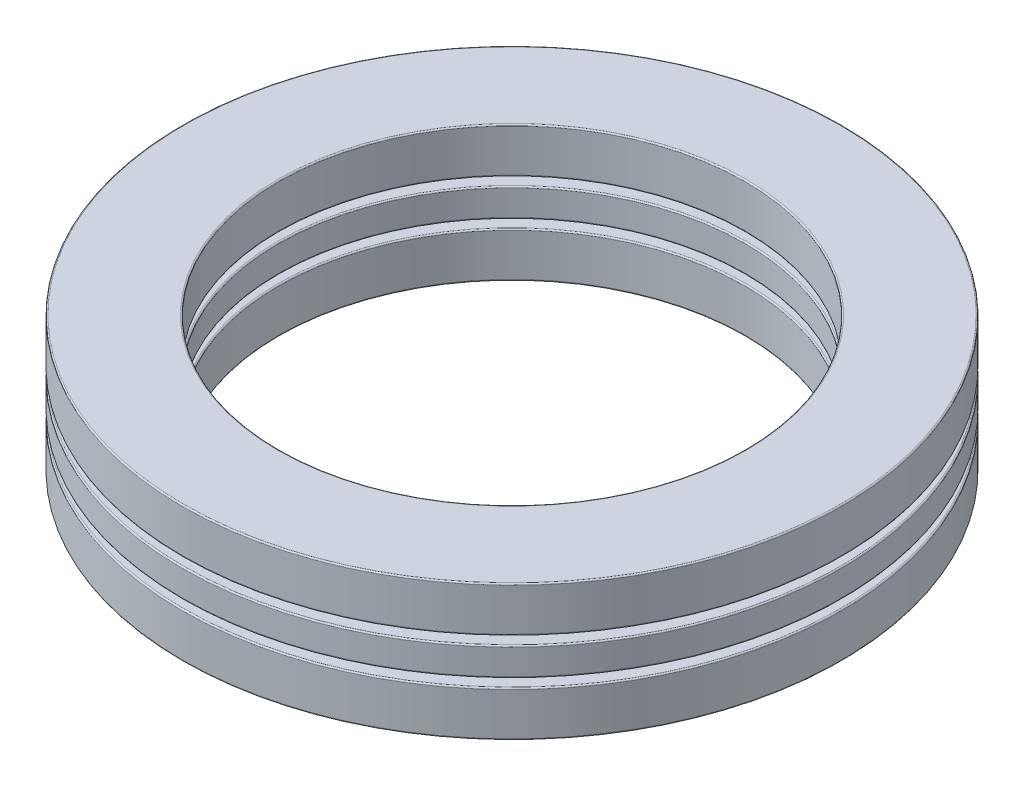
ISO-10303-21;
HEADER;
FILE_DESCRIPTION(('STEP AP214'),'2;1');
FILE_NAME('part.step','',(''),(''),'','','');
FILE_SCHEMA(('AUTOMOTIVE_DESIGN { 1 0 10303 214 1 1 1 1 }'));
ENDSEC;
DATA;
#1=APPLICATION_CONTEXT('core data for automotive mechanical design processes');
#2=APPLICATION_PROTOCOL_DEFINITION('international standard','automotive_design',2000,#1);
#3=PRODUCT_CONTEXT('',#1,'mechanical');
#4=PRODUCT('Part','Part','',(#3));
#5=PRODUCT_RELATED_PRODUCT_CATEGORY('part','',(#4));
#6=PRODUCT_DEFINITION_FORMATION('','',#4);
#7=PRODUCT_DEFINITION_CONTEXT('part definition',#1,'design');
#8=PRODUCT_DEFINITION('design','',#6,#7);
#9=PRODUCT_DEFINITION_SHAPE('','',#8);
#10=(LENGTH_UNIT() NAMED_UNIT(*) SI_UNIT(.MILLI.,.METRE.));
#11=(NAMED_UNIT(*) PLANE_ANGLE_UNIT() SI_UNIT($,.RADIAN.));
#12=(NAMED_UNIT(*) SI_UNIT($,.STERADIAN.) SOLID_ANGLE_UNIT());
#13=UNCERTAINTY_MEASURE_WITH_UNIT(LENGTH_MEASURE(1.E-05),#10,'distance_accuracy_value','');
#14=(GEOMETRIC_REPRESENTATION_CONTEXT(3) GLOBAL_UNCERTAINTY_ASSIGNED_CONTEXT((#13)) GLOBAL_UNIT_ASSIGNED_CONTEXT((#10,
#11,#12)) REPRESENTATION_CONTEXT('',''));
#15=CARTESIAN_POINT('',(0.,0.,0.));
#16=DIRECTION('',(0.,0.,1.));
#17=DIRECTION('',(1.,0.,0.));
#18=AXIS2_PLACEMENT_3D('',#15,#16,#17);
#19=CARTESIAN_POINT('',(0.,-5.5499,0.));
#20=DIRECTION('',(0.,-1.,0.));
#21=DIRECTION('',(0.,0.,-1.));
#22=AXIS2_PLACEMENT_3D('',#19,#20,#21);
#23=CYLINDRICAL_SURFACE('',#22,26.9875);
#24=CARTESIAN_POINT('',(0.,-5.438902,0.));
#25=DIRECTION('',(0.,1.,0.));
#26=DIRECTION('',(0.,0.,1.));
#27=AXIS2_PLACEMENT_3D('',#24,#25,#26);
#28=CIRCLE('',#27,26.9875);
#29=CARTESIAN_POINT('',(0.,-5.438902,26.9875));
#30=VERTEX_POINT('',#29);
#31=EDGE_CURVE('E11',#30,#30,#28,.T.);
#32=ORIENTED_EDGE('',*,*,#31,.T.);
#33=EDGE_LOOP('',(#32));
#34=FACE_BOUND('',#33,.T.);
#35=CARTESIAN_POINT('',(0.,-1.96096466666667,0.));
#36=DIRECTION('',(0.,-1.,0.));
#37=DIRECTION('',(0.,0.,-1.));
#38=AXIS2_PLACEMENT_3D('',#35,#36,#37);
#39=CIRCLE('',#38,26.9875);
#40=CARTESIAN_POINT('',(0.,-1.96096466666667,-26.9875));
#41=VERTEX_POINT('',#40);
#42=EDGE_CURVE('E51',#41,#41,#39,.T.);
#43=ORIENTED_EDGE('',*,*,#42,.T.);
#44=EDGE_LOOP('',(#43));
#45=FACE_BOUND('',#44,.T.);
#46=ADVANCED_FACE('F44',(#34,#45),#23,.T.);
#47=CARTESIAN_POINT('',(0.,-1.84996666666667,26.9875));
#48=DIRECTION('',(0.,-1.,0.));
#49=DIRECTION('',(0.,0.,-1.));
#50=AXIS2_PLACEMENT_3D('',#47,#48,#49);
#51=PLANE('',#50);
#52=CARTESIAN_POINT('',(0.,-1.84996666666667,0.));
#53=DIRECTION('',(0.,-1.,0.));
#54=DIRECTION('',(0.,0.,-1.));
#55=AXIS2_PLACEMENT_3D('',#52,#53,#54);
#56=CIRCLE('',#55,19.199098);
#57=CARTESIAN_POINT('',(0.,-1.84996666666667,-19.199098));
#58=VERTEX_POINT('',#57);
#59=EDGE_CURVE('E55',#58,#58,#56,.T.);
#60=ORIENTED_EDGE('',*,*,#59,.T.);
#61=EDGE_LOOP('',(#60));
#62=FACE_BOUND('',#61,.T.);
#63=CARTESIAN_POINT('',(0.,-1.84996666666667,0.));
#64=DIRECTION('',(0.,-1.,0.));
#65=DIRECTION('',(0.,0.,-1.));
#66=AXIS2_PLACEMENT_3D('',#63,#64,#65);
#67=CIRCLE('',#66,26.876502);
#68=CARTESIAN_POINT('',(0.,-1.84996666666667,-26.876502));
#69=VERTEX_POINT('',#68);
#70=EDGE_CURVE('E59',#69,#69,#67,.F.);
#71=ORIENTED_EDGE('',*,*,#70,.T.);
#72=EDGE_LOOP('',(#71));
#73=FACE_BOUND('',#72,.T.);
#74=ADVANCED_FACE('F87',(#62,#73),#51,.F.);
#75=CARTESIAN_POINT('',(0.,-5.5499,0.));
#76=DIRECTION('',(0.,-1.,0.));
#77=DIRECTION('',(0.,0.,-1.));
#78=AXIS2_PLACEMENT_3D('',#75,#76,#77);
#79=CYLINDRICAL_SURFACE('',#78,19.0881);
#80=CARTESIAN_POINT('',(0.,-5.438902,0.));
#81=DIRECTION('',(0.,1.,0.));
#82=DIRECTION('',(0.,0.,1.));
#83=AXIS2_PLACEMENT_3D('',#80,#81,#82);
#84=CIRCLE('',#83,19.0881);
#85=CARTESIAN_POINT('',(0.,-5.438902,19.0881));
#86=VERTEX_POINT('',#85);
#87=EDGE_CURVE('E70',#86,#86,#84,.F.);
#88=ORIENTED_EDGE('',*,*,#87,.T.);
#89=EDGE_LOOP('',(#88));
#90=FACE_BOUND('',#89,.T.);
#91=CARTESIAN_POINT('',(0.,-1.96096466666667,0.));
#92=DIRECTION('',(0.,-1.,0.));
#93=DIRECTION('',(0.,0.,-1.));
#94=AXIS2_PLACEMENT_3D('',#91,#92,#93);
#95=CIRCLE('',#94,19.0881);
#96=CARTESIAN_POINT('',(0.,-1.96096466666667,-19.0881));
#97=VERTEX_POINT('',#96);
#98=EDGE_CURVE('E73',#97,#97,#95,.F.);
#99=ORIENTED_EDGE('',*,*,#98,.T.);
#100=EDGE_LOOP('',(#99));
#101=FACE_BOUND('',#100,.T.);
#102=ADVANCED_FACE('F77',(#90,#101),#79,.F.);
#103=CARTESIAN_POINT('',(0.,-5.5499,26.9875));
#104=DIRECTION('',(0.,1.,0.));
#105=DIRECTION('',(0.,0.,1.));
#106=AXIS2_PLACEMENT_3D('',#103,#104,#105);
#107=PLANE('',#106);
#108=CARTESIAN_POINT('',(0.,-5.5499,0.));
#109=DIRECTION('',(0.,1.,0.));
#110=DIRECTION('',(0.,0.,1.));
#111=AXIS2_PLACEMENT_3D('',#108,#109,#110);
#112=CIRCLE('',#111,19.199098);
#113=CARTESIAN_POINT('',(0.,-5.5499,19.199098));
#114=VERTEX_POINT('',#113);
#115=EDGE_CURVE('E64',#114,#114,#112,.T.);
#116=ORIENTED_EDGE('',*,*,#115,.T.);
#117=EDGE_LOOP('',(#116));
#118=FACE_BOUND('',#117,.T.);
#119=CARTESIAN_POINT('',(0.,-5.5499,0.));
#120=DIRECTION('',(0.,1.,0.));
#121=DIRECTION('',(0.,0.,1.));
#122=AXIS2_PLACEMENT_3D('',#119,#120,#121);
#123=CIRCLE('',#122,26.876502);
#124=CARTESIAN_POINT('',(0.,-5.5499,26.876502));
#125=VERTEX_POINT('',#124);
#126=EDGE_CURVE('E67',#125,#125,#123,.F.);
#127=ORIENTED_EDGE('',*,*,#126,.T.);
#128=EDGE_LOOP('',(#127));
#129=FACE_BOUND('',#128,.T.);
#130=ADVANCED_FACE('F106',(#118,#129),#107,.F.);
#131=CARTESIAN_POINT('',(0.,-5.438902,0.));
#132=DIRECTION('',(0.,1.,0.));
#133=DIRECTION('',(0.,0.,1.));
#134=AXIS2_PLACEMENT_3D('',#131,#132,#133);
#135=TOROIDAL_SURFACE('',#134,19.199098,0.110998);
#136=ORIENTED_EDGE('',*,*,#115,.F.);
#137=EDGE_LOOP('',(#136));
#138=FACE_BOUND('',#137,.T.);
#139=ORIENTED_EDGE('',*,*,#87,.F.);
#140=EDGE_LOOP('',(#139));
#141=FACE_BOUND('',#140,.T.);
#142=ADVANCED_FACE('F83',(#138,#141),#135,.T.);
#143=CARTESIAN_POINT('',(0.,-1.96096466666667,0.));
#144=DIRECTION('',(0.,-1.,0.));
#145=DIRECTION('',(0.,0.,-1.));
#146=AXIS2_PLACEMENT_3D('',#143,#144,#145);
#147=TOROIDAL_SURFACE('',#146,19.199098,0.110998);
#148=ORIENTED_EDGE('',*,*,#98,.F.);
#149=EDGE_LOOP('',(#148));
#150=FACE_BOUND('',#149,.T.);
#151=ORIENTED_EDGE('',*,*,#59,.F.);
#152=EDGE_LOOP('',(#151));
#153=FACE_BOUND('',#152,.T.);
#154=ADVANCED_FACE('F79',(#150,#153),#147,.T.);
#155=CARTESIAN_POINT('',(0.,-5.438902,0.));
#156=DIRECTION('',(0.,1.,0.));
#157=DIRECTION('',(0.,0.,1.));
#158=AXIS2_PLACEMENT_3D('',#155,#156,#157);
#159=TOROIDAL_SURFACE('',#158,26.876502,0.110998);
#160=ORIENTED_EDGE('',*,*,#31,.F.);
#161=EDGE_LOOP('',(#160));
#162=FACE_BOUND('',#161,.T.);
#163=ORIENTED_EDGE('',*,*,#126,.F.);
#164=EDGE_LOOP('',(#163));
#165=FACE_BOUND('',#164,.T.);
#166=ADVANCED_FACE('F82',(#162,#165),#159,.T.);
#167=CARTESIAN_POINT('',(0.,-1.96096466666667,0.));
#168=DIRECTION('',(0.,-1.,0.));
#169=DIRECTION('',(0.,0.,-1.));
#170=AXIS2_PLACEMENT_3D('',#167,#168,#169);
#171=TOROIDAL_SURFACE('',#170,26.876502,0.110998);
#172=ORIENTED_EDGE('',*,*,#70,.F.);
#173=EDGE_LOOP('',(#172));
#174=FACE_BOUND('',#173,.T.);
#175=ORIENTED_EDGE('',*,*,#42,.F.);
#176=EDGE_LOOP('',(#175));
#177=FACE_BOUND('',#176,.T.);
#178=ADVANCED_FACE('F46',(#174,#177),#171,.T.);
#179=CLOSED_SHELL('',(#46,#74,#102,#130,#142,#154,#166,#178));
#180=MANIFOLD_SOLID_BREP('B2',#179);
#181=CARTESIAN_POINT('',(0.,-5.5499,0.));
#182=DIRECTION('',(0.,-1.,0.));
#183=DIRECTION('',(0.,0.,-1.));
#184=AXIS2_PLACEMENT_3D('',#181,#182,#183);
#185=CYLINDRICAL_SURFACE('',#184,26.9875);
#186=CARTESIAN_POINT('',(0.,1.96096466666667,0.));
#187=DIRECTION('',(0.,1.,0.));
#188=DIRECTION('',(0.,0.,1.));
#189=AXIS2_PLACEMENT_3D('',#186,#187,#188);
#190=CIRCLE('',#189,26.9875);
#191=CARTESIAN_POINT('',(0.,1.96096466666667,26.9875));
#192=VERTEX_POINT('',#191);
#193=EDGE_CURVE('E43',#192,#192,#190,.T.);
#194=ORIENTED_EDGE('',*,*,#193,.T.);
#195=EDGE_LOOP('',(#194));
#196=FACE_BOUND('',#195,.T.);
#197=CARTESIAN_POINT('',(0.,5.438902,0.));
#198=DIRECTION('',(0.,-1.,0.));
#199=DIRECTION('',(0.,0.,-1.));
#200=AXIS2_PLACEMENT_3D('',#197,#198,#199);
#201=CIRCLE('',#200,26.9875);
#202=CARTESIAN_POINT('',(0.,5.438902,-26.9875));
#203=VERTEX_POINT('',#202);
#204=EDGE_CURVE('E163',#203,#203,#201,.T.);
#205=ORIENTED_EDGE('',*,*,#204,.T.);
#206=EDGE_LOOP('',(#205));
#207=FACE_BOUND('',#206,.T.);
#208=ADVANCED_FACE('F156',(#196,#207),#185,.T.);
#209=CARTESIAN_POINT('',(0.,5.5499,26.9875));
#210=DIRECTION('',(0.,-1.,0.));
#211=DIRECTION('',(0.,0.,-1.));
#212=AXIS2_PLACEMENT_3D('',#209,#210,#211);
#213=PLANE('',#212);
#214=CARTESIAN_POINT('',(0.,5.5499,0.));
#215=DIRECTION('',(0.,-1.,0.));
#216=DIRECTION('',(0.,0.,-1.));
#217=AXIS2_PLACEMENT_3D('',#214,#215,#216);
#218=CIRCLE('',#217,19.199098);
#219=CARTESIAN_POINT('',(0.,5.5499,-19.199098));
#220=VERTEX_POINT('',#219);
#221=EDGE_CURVE('E167',#220,#220,#218,.T.);
#222=ORIENTED_EDGE('',*,*,#221,.T.);
#223=EDGE_LOOP('',(#222));
#224=FACE_BOUND('',#223,.T.);
#225=CARTESIAN_POINT('',(0.,5.5499,0.));
#226=DIRECTION('',(0.,-1.,0.));
#227=DIRECTION('',(0.,0.,-1.));
#228=AXIS2_PLACEMENT_3D('',#225,#226,#227);
#229=CIRCLE('',#228,26.876502);
#230=CARTESIAN_POINT('',(0.,5.5499,-26.876502));
#231=VERTEX_POINT('',#230);
#232=EDGE_CURVE('E171',#231,#231,#229,.F.);
#233=ORIENTED_EDGE('',*,*,#232,.T.);
#234=EDGE_LOOP('',(#233));
#235=FACE_BOUND('',#234,.T.);
#236=ADVANCED_FACE('F199',(#224,#235),#213,.F.);
#237=CARTESIAN_POINT('',(0.,-5.5499,0.));
#238=DIRECTION('',(0.,-1.,0.));
#239=DIRECTION('',(0.,0.,-1.));
#240=AXIS2_PLACEMENT_3D('',#237,#238,#239);
#241=CYLINDRICAL_SURFACE('',#240,19.0881);
#242=CARTESIAN_POINT('',(0.,1.96096466666667,0.));
#243=DIRECTION('',(0.,1.,0.));
#244=DIRECTION('',(0.,0.,1.));
#245=AXIS2_PLACEMENT_3D('',#242,#243,#244);
#246=CIRCLE('',#245,19.0881);
#247=CARTESIAN_POINT('',(0.,1.96096466666667,19.0881));
#248=VERTEX_POINT('',#247);
#249=EDGE_CURVE('E182',#248,#248,#246,.F.);
#250=ORIENTED_EDGE('',*,*,#249,.T.);
#251=EDGE_LOOP('',(#250));
#252=FACE_BOUND('',#251,.T.);
#253=CARTESIAN_POINT('',(0.,5.438902,0.));
#254=DIRECTION('',(0.,-1.,0.));
#255=DIRECTION('',(0.,0.,-1.));
#256=AXIS2_PLACEMENT_3D('',#253,#254,#255);
#257=CIRCLE('',#256,19.0881);
#258=CARTESIAN_POINT('',(0.,5.438902,-19.0881));
#259=VERTEX_POINT('',#258);
#260=EDGE_CURVE('E185',#259,#259,#257,.F.);
#261=ORIENTED_EDGE('',*,*,#260,.T.);
#262=EDGE_LOOP('',(#261));
#263=FACE_BOUND('',#262,.T.);
#264=ADVANCED_FACE('F189',(#252,#263),#241,.F.);
#265=CARTESIAN_POINT('',(0.,1.84996666666667,26.9875));
#266=DIRECTION('',(0.,1.,0.));
#267=DIRECTION('',(0.,0.,1.));
#268=AXIS2_PLACEMENT_3D('',#265,#266,#267);
#269=PLANE('',#268);
#270=CARTESIAN_POINT('',(0.,1.84996666666667,0.));
#271=DIRECTION('',(0.,1.,0.));
#272=DIRECTION('',(0.,0.,1.));
#273=AXIS2_PLACEMENT_3D('',#270,#271,#272);
#274=CIRCLE('',#273,19.199098);
#275=CARTESIAN_POINT('',(0.,1.84996666666667,19.199098));
#276=VERTEX_POINT('',#275);
#277=EDGE_CURVE('E176',#276,#276,#274,.T.);
#278=ORIENTED_EDGE('',*,*,#277,.T.);
#279=EDGE_LOOP('',(#278));
#280=FACE_BOUND('',#279,.T.);
#281=CARTESIAN_POINT('',(0.,1.84996666666667,0.));
#282=DIRECTION('',(0.,1.,0.));
#283=DIRECTION('',(0.,0.,1.));
#284=AXIS2_PLACEMENT_3D('',#281,#282,#283);
#285=CIRCLE('',#284,26.876502);
#286=CARTESIAN_POINT('',(0.,1.84996666666667,26.876502));
#287=VERTEX_POINT('',#286);
#288=EDGE_CURVE('E179',#287,#287,#285,.F.);
#289=ORIENTED_EDGE('',*,*,#288,.T.);
#290=EDGE_LOOP('',(#289));
#291=FACE_BOUND('',#290,.T.);
#292=ADVANCED_FACE('F218',(#280,#291),#269,.F.);
#293=CARTESIAN_POINT('',(0.,1.96096466666667,0.));
#294=DIRECTION('',(0.,1.,0.));
#295=DIRECTION('',(0.,0.,1.));
#296=AXIS2_PLACEMENT_3D('',#293,#294,#295);
#297=TOROIDAL_SURFACE('',#296,19.199098,0.110998);
#298=ORIENTED_EDGE('',*,*,#277,.F.);
#299=EDGE_LOOP('',(#298));
#300=FACE_BOUND('',#299,.T.);
#301=ORIENTED_EDGE('',*,*,#249,.F.);
#302=EDGE_LOOP('',(#301));
#303=FACE_BOUND('',#302,.T.);
#304=ADVANCED_FACE('F195',(#300,#303),#297,.T.);
#305=CARTESIAN_POINT('',(0.,5.438902,0.));
#306=DIRECTION('',(0.,-1.,0.));
#307=DIRECTION('',(0.,0.,-1.));
#308=AXIS2_PLACEMENT_3D('',#305,#306,#307);
#309=TOROIDAL_SURFACE('',#308,19.199098,0.110998);
#310=ORIENTED_EDGE('',*,*,#260,.F.);
#311=EDGE_LOOP('',(#310));
#312=FACE_BOUND('',#311,.T.);
#313=ORIENTED_EDGE('',*,*,#221,.F.);
#314=EDGE_LOOP('',(#313));
#315=FACE_BOUND('',#314,.T.);
#316=ADVANCED_FACE('F191',(#312,#315),#309,.T.);
#317=CARTESIAN_POINT('',(0.,1.96096466666667,0.));
#318=DIRECTION('',(0.,1.,0.));
#319=DIRECTION('',(0.,0.,1.));
#320=AXIS2_PLACEMENT_3D('',#317,#318,#319);
#321=TOROIDAL_SURFACE('',#320,26.876502,0.110998);
#322=ORIENTED_EDGE('',*,*,#193,.F.);
#323=EDGE_LOOP('',(#322));
#324=FACE_BOUND('',#323,.T.);
#325=ORIENTED_EDGE('',*,*,#288,.F.);
#326=EDGE_LOOP('',(#325));
#327=FACE_BOUND('',#326,.T.);
#328=ADVANCED_FACE('F194',(#324,#327),#321,.T.);
#329=CARTESIAN_POINT('',(0.,5.438902,0.));
#330=DIRECTION('',(0.,-1.,0.));
#331=DIRECTION('',(0.,0.,-1.));
#332=AXIS2_PLACEMENT_3D('',#329,#330,#331);
#333=TOROIDAL_SURFACE('',#332,26.876502,0.110998);
#334=ORIENTED_EDGE('',*,*,#232,.F.);
#335=EDGE_LOOP('',(#334));
#336=FACE_BOUND('',#335,.T.);
#337=ORIENTED_EDGE('',*,*,#204,.F.);
#338=EDGE_LOOP('',(#337));
#339=FACE_BOUND('',#338,.T.);
#340=ADVANCED_FACE('F158',(#336,#339),#333,.T.);
#341=CLOSED_SHELL('',(#208,#236,#264,#292,#304,#316,#328,#340));
#342=MANIFOLD_SOLID_BREP('B6',#341);
#343=CARTESIAN_POINT('',(-12.4551750243783,0.,19.3806306386583));
#344=DIRECTION('',(0.,1.,0.));
#345=DIRECTION('',(0.540640817455587,0.,-0.841253532831188));
#346=AXIS2_PLACEMENT_3D('',#343,#344,#345);
#347=SPHERICAL_SURFACE('',#346,1.84996666666667);
#348=CARTESIAN_POINT('',(-12.4551750243783,1.84996666666667,19.3806306386583));
#349=VERTEX_POINT('',#348);
#350=VERTEX_LOOP('',#349);
#351=FACE_BOUND('',#350,.T.);
#352=ADVANCED_FACE('F268',(#351),#347,.T.);
#353=CLOSED_SHELL('',(#352));
#354=MANIFOLD_SOLID_BREP('B38',#353);
#355=CARTESIAN_POINT('',(-20.9559199825782,0.,9.57024798653509));
#356=DIRECTION('',(0.,1.,0.));
#357=DIRECTION('',(0.909631995354514,0.,-0.415415013001897));
#358=AXIS2_PLACEMENT_3D('',#355,#356,#357);
#359=SPHERICAL_SURFACE('',#358,1.84996666666667);
#360=CARTESIAN_POINT('',(-20.9559199825782,1.84996666666667,9.57024798653509));
#361=VERTEX_POINT('',#360);
#362=VERTEX_LOOP('',#361);
#363=FACE_BOUND('',#362,.T.);
#364=ADVANCED_FACE('F285',(#363),#359,.T.);
#365=CLOSED_SHELL('',(#364));
#366=MANIFOLD_SOLID_BREP('B152',#365);
#367=CARTESIAN_POINT('',(-22.8033084137646,0.,-3.27862078117207));
#368=DIRECTION('',(0.,1.,0.));
#369=DIRECTION('',(0.989821441880934,0.,0.142314838273276));
#370=AXIS2_PLACEMENT_3D('',#367,#368,#369);
#371=SPHERICAL_SURFACE('',#370,1.84996666666667);
#372=CARTESIAN_POINT('',(-22.8033084137646,1.84996666666667,-3.27862078117207));
#373=VERTEX_POINT('',#372);
#374=VERTEX_LOOP('',#373);
#375=FACE_BOUND('',#374,.T.);
#376=ADVANCED_FACE('F302',(#375),#371,.T.);
#377=CLOSED_SHELL('',(#376));
#378=MANIFOLD_SOLID_BREP('B264',#377);
#379=CARTESIAN_POINT('',(-17.4108075440587,0.,-15.0865506164845));
#380=DIRECTION('',(0.,1.,0.));
#381=DIRECTION('',(0.755749574354264,0.,0.654860733945279));
#382=AXIS2_PLACEMENT_3D('',#379,#380,#381);
#383=SPHERICAL_SURFACE('',#382,1.84996666666667);
#384=CARTESIAN_POINT('',(-17.4108075440587,1.84996666666667,-15.0865506164845));
#385=VERTEX_POINT('',#384);
#386=VERTEX_LOOP('',#385);
#387=FACE_BOUND('',#386,.T.);
#388=ADVANCED_FACE('F319',(#387),#383,.T.);
#389=CLOSED_SHELL('',(#388));
#390=MANIFOLD_SOLID_BREP('B281',#389);
#391=CARTESIAN_POINT('',(-6.49049829800165,0.,-22.104607227536));
#392=DIRECTION('',(0.,1.,0.));
#393=DIRECTION('',(0.281732556841437,0.,0.959492973614495));
#394=AXIS2_PLACEMENT_3D('',#391,#392,#393);
#395=SPHERICAL_SURFACE('',#394,1.84996666666667);
#396=CARTESIAN_POINT('',(-6.49049829800165,1.84996666666667,-22.104607227536));
#397=VERTEX_POINT('',#396);
#398=VERTEX_LOOP('',#397);
#399=FACE_BOUND('',#398,.T.);
#400=ADVANCED_FACE('F336',(#399),#395,.T.);
#401=CLOSED_SHELL('',(#400));
#402=MANIFOLD_SOLID_BREP('B298',#401);
#403=CARTESIAN_POINT('',(6.49049829800135,0.,-22.1046072275361));
#404=DIRECTION('',(0.,1.,0.));
#405=DIRECTION('',(-0.281732556841424,0.,0.959492973614499));
#406=AXIS2_PLACEMENT_3D('',#403,#404,#405);
#407=SPHERICAL_SURFACE('',#406,1.84996666666667);
#408=CARTESIAN_POINT('',(6.49049829800135,1.84996666666667,-22.1046072275361));
#409=VERTEX_POINT('',#408);
#410=VERTEX_LOOP('',#409);
#411=FACE_BOUND('',#410,.T.);
#412=ADVANCED_FACE('F353',(#411),#407,.T.);
#413=CLOSED_SHELL('',(#412));
#414=MANIFOLD_SOLID_BREP('B315',#413);
#415=CARTESIAN_POINT('',(17.4108075440585,0.,-15.0865506164848));
#416=DIRECTION('',(0.,1.,0.));
#417=DIRECTION('',(-0.755749574354255,0.,0.654860733945289));
#418=AXIS2_PLACEMENT_3D('',#415,#416,#417);
#419=SPHERICAL_SURFACE('',#418,1.84996666666667);
#420=CARTESIAN_POINT('',(17.4108075440585,1.84996666666667,-15.0865506164848));
#421=VERTEX_POINT('',#420);
#422=VERTEX_LOOP('',#421);
#423=FACE_BOUND('',#422,.T.);
#424=ADVANCED_FACE('F370',(#423),#419,.T.);
#425=CLOSED_SHELL('',(#424));
#426=MANIFOLD_SOLID_BREP('B332',#425);
#427=CARTESIAN_POINT('',(22.8033084137645,0.,-3.27862078117237));
#428=DIRECTION('',(0.,1.,0.));
#429=DIRECTION('',(-0.989821441880932,0.,0.142314838273289));
#430=AXIS2_PLACEMENT_3D('',#427,#428,#429);
#431=SPHERICAL_SURFACE('',#430,1.84996666666667);
#432=CARTESIAN_POINT('',(22.8033084137645,1.84996666666667,-3.27862078117237));
#433=VERTEX_POINT('',#432);
#434=VERTEX_LOOP('',#433);
#435=FACE_BOUND('',#434,.T.);
#436=ADVANCED_FACE('F387',(#435),#431,.T.);
#437=CLOSED_SHELL('',(#436));
#438=MANIFOLD_SOLID_BREP('B349',#437);
#439=CARTESIAN_POINT('',(20.9559199825783,0.,9.57024798653481));
#440=DIRECTION('',(0.,1.,0.));
#441=DIRECTION('',(-0.90963199535452,0.,-0.415415013001884));
#442=AXIS2_PLACEMENT_3D('',#439,#440,#441);
#443=SPHERICAL_SURFACE('',#442,1.84996666666667);
#444=CARTESIAN_POINT('',(20.9559199825783,1.84996666666667,9.57024798653481));
#445=VERTEX_POINT('',#444);
#446=VERTEX_LOOP('',#445);
#447=FACE_BOUND('',#446,.T.);
#448=ADVANCED_FACE('F404',(#447),#443,.T.);
#449=CLOSED_SHELL('',(#448));
#450=MANIFOLD_SOLID_BREP('B366',#449);
#451=CARTESIAN_POINT('',(12.4551750243786,0.,19.3806306386582));
#452=DIRECTION('',(0.,1.,0.));
#453=DIRECTION('',(-0.540640817455599,0.,-0.841253532831181));
#454=AXIS2_PLACEMENT_3D('',#451,#452,#453);
#455=SPHERICAL_SURFACE('',#454,1.84996666666667);
#456=CARTESIAN_POINT('',(12.4551750243786,1.84996666666667,19.3806306386582));
#457=VERTEX_POINT('',#456);
#458=VERTEX_LOOP('',#457);
#459=FACE_BOUND('',#458,.T.);
#460=ADVANCED_FACE('F421',(#459),#455,.T.);
#461=CLOSED_SHELL('',(#460));
#462=MANIFOLD_SOLID_BREP('B383',#461);
#463=CARTESIAN_POINT('',(0.,0.,23.0378));
#464=DIRECTION('',(0.,1.,0.));
#465=DIRECTION('',(0.,0.,-1.));
#466=AXIS2_PLACEMENT_3D('',#463,#464,#465);
#467=SPHERICAL_SURFACE('',#466,1.84996666666667);
#468=CARTESIAN_POINT('',(0.,1.84996666666667,23.0378));
#469=VERTEX_POINT('',#468);
#470=VERTEX_LOOP('',#469);
#471=FACE_BOUND('',#470,.T.);
#472=ADVANCED_FACE('F439',(#471),#467,.T.);
#473=CLOSED_SHELL('',(#472));
#474=MANIFOLD_SOLID_BREP('B400',#473);
#475=CARTESIAN_POINT('',(0.,-5.5499,0.));
#476=DIRECTION('',(0.,-1.,0.));
#477=DIRECTION('',(0.,0.,-1.));
#478=AXIS2_PLACEMENT_3D('',#475,#476,#477);
#479=CYLINDRICAL_SURFACE('',#478,26.9875);
#480=CARTESIAN_POINT('',(0.,-1.04523116666667,0.));
#481=DIRECTION('',(0.,1.,0.));
#482=DIRECTION('',(0.,0.,1.));
#483=AXIS2_PLACEMENT_3D('',#480,#481,#482);
#484=CIRCLE('',#483,26.9875);
#485=CARTESIAN_POINT('',(0.,-1.04523116666667,26.9875));
#486=VERTEX_POINT('',#485);
#487=EDGE_CURVE('E438',#486,#486,#484,.T.);
#488=ORIENTED_EDGE('',*,*,#487,.T.);
#489=EDGE_LOOP('',(#488));
#490=FACE_BOUND('',#489,.T.);
#491=CARTESIAN_POINT('',(0.,1.04523116666667,0.));
#492=DIRECTION('',(0.,-1.,0.));
#493=DIRECTION('',(0.,0.,-1.));
#494=AXIS2_PLACEMENT_3D('',#491,#492,#493);
#495=CIRCLE('',#494,26.9875);
#496=CARTESIAN_POINT('',(0.,1.04523116666667,-26.9875));
#497=VERTEX_POINT('',#496);
#498=EDGE_CURVE('E457',#497,#497,#495,.T.);
#499=ORIENTED_EDGE('',*,*,#498,.T.);
#500=EDGE_LOOP('',(#499));
#501=FACE_BOUND('',#500,.T.);
#502=ADVANCED_FACE('F450',(#490,#501),#479,.T.);
#503=CARTESIAN_POINT('',(0.,-1.15622916666667,26.9875));
#504=DIRECTION('',(0.,1.,0.));
#505=DIRECTION('',(0.,0.,1.));
#506=AXIS2_PLACEMENT_3D('',#503,#504,#505);
#507=PLANE('',#506);
#508=CARTESIAN_POINT('',(0.,-1.15622916666667,0.));
#509=DIRECTION('',(0.,1.,0.));
#510=DIRECTION('',(0.,0.,1.));
#511=AXIS2_PLACEMENT_3D('',#508,#509,#510);
#512=CIRCLE('',#511,19.199098);
#513=CARTESIAN_POINT('',(0.,-1.15622916666667,19.199098));
#514=VERTEX_POINT('',#513);
#515=EDGE_CURVE('E470',#514,#514,#512,.T.);
#516=ORIENTED_EDGE('',*,*,#515,.T.);
#517=EDGE_LOOP('',(#516));
#518=FACE_BOUND('',#517,.T.);
#519=CARTESIAN_POINT('',(0.,-1.15622916666667,0.));
#520=DIRECTION('',(0.,1.,0.));
#521=DIRECTION('',(0.,0.,1.));
#522=AXIS2_PLACEMENT_3D('',#519,#520,#521);
#523=CIRCLE('',#522,26.876502);
#524=CARTESIAN_POINT('',(0.,-1.15622916666667,26.876502));
#525=VERTEX_POINT('',#524);
#526=EDGE_CURVE('E473',#525,#525,#523,.F.);
#527=ORIENTED_EDGE('',*,*,#526,.T.);
#528=EDGE_LOOP('',(#527));
#529=FACE_BOUND('',#528,.T.);
#530=CARTESIAN_POINT('',(-12.4551750243783,-1.15622916666667,19.3806306386583));
#531=DIRECTION('',(0.,1.,0.));
#532=DIRECTION('',(-0.540640817455587,0.,0.841253532831188));
#533=AXIS2_PLACEMENT_3D('',#530,#531,#532);
#534=CIRCLE('',#533,1.44412976630463);
#535=CARTESIAN_POINT('',(-13.2359305217452,-1.15622916666667,20.5955099064288));
#536=VERTEX_POINT('',#535);
#537=EDGE_CURVE('E542',#536,#536,#534,.T.);
#538=ORIENTED_EDGE('',*,*,#537,.T.);
#539=EDGE_LOOP('',(#538));
#540=FACE_BOUND('',#539,.T.);
#541=CARTESIAN_POINT('',(-20.9559199825782,-1.15622916666667,9.57024798653509));
#542=DIRECTION('',(0.,1.,0.));
#543=DIRECTION('',(-0.909631995354514,0.,0.415415013001897));
#544=AXIS2_PLACEMENT_3D('',#541,#542,#543);
#545=CIRCLE('',#544,1.44412976630463);
#546=CARTESIAN_POINT('',(-22.2695466234527,-1.15622916666667,10.170161172181));
#547=VERTEX_POINT('',#546);
#548=EDGE_CURVE('E536',#547,#547,#545,.T.);
#549=ORIENTED_EDGE('',*,*,#548,.T.);
#550=EDGE_LOOP('',(#549));
#551=FACE_BOUND('',#550,.T.);
#552=CARTESIAN_POINT('',(-22.8033084137646,-1.15622916666667,-3.27862078117207));
#553=DIRECTION('',(0.,1.,0.));
#554=DIRECTION('',(-0.989821441880934,0.,-0.142314838273276));
#555=AXIS2_PLACEMENT_3D('',#552,#553,#554);
#556=CIRCLE('',#555,1.44412976630463);
#557=CARTESIAN_POINT('',(-24.2327390213114,-1.15622916666667,-3.48414187530933));
#558=VERTEX_POINT('',#557);
#559=EDGE_CURVE('E530',#558,#558,#556,.T.);
#560=ORIENTED_EDGE('',*,*,#559,.T.);
#561=EDGE_LOOP('',(#560));
#562=FACE_BOUND('',#561,.T.);
#563=CARTESIAN_POINT('',(-17.4108075440587,-1.15622916666667,-15.0865506164845));
#564=DIRECTION('',(0.,1.,0.));
#565=DIRECTION('',(-0.755749574354264,0.,-0.654860733945279));
#566=AXIS2_PLACEMENT_3D('',#563,#564,#565);
#567=CIRCLE('',#566,1.44412976630463);
#568=CARTESIAN_POINT('',(-18.5022080002557,-1.15622916666667,-16.032254495159));
#569=VERTEX_POINT('',#568);
#570=EDGE_CURVE('E524',#569,#569,#567,.T.);
#571=ORIENTED_EDGE('',*,*,#570,.T.);
#572=EDGE_LOOP('',(#571));
#573=FACE_BOUND('',#572,.T.);
#574=CARTESIAN_POINT('',(-6.49049829800165,-1.15622916666667,-22.104607227536));
#575=DIRECTION('',(0.,1.,0.));
#576=DIRECTION('',(-0.281732556841437,0.,-0.959492973614495));
#577=AXIS2_PLACEMENT_3D('',#574,#575,#576);
#578=CIRCLE('',#577,1.44412976630463);
#579=CARTESIAN_POINT('',(-6.89735666947348,-1.15622916666667,-23.4902395912929));
#580=VERTEX_POINT('',#579);
#581=EDGE_CURVE('E518',#580,#580,#578,.T.);
#582=ORIENTED_EDGE('',*,*,#581,.T.);
#583=EDGE_LOOP('',(#582));
#584=FACE_BOUND('',#583,.T.);
#585=CARTESIAN_POINT('',(6.49049829800135,-1.15622916666667,-22.1046072275361));
#586=DIRECTION('',(0.,1.,0.));
#587=DIRECTION('',(0.281732556841424,0.,-0.959492973614499));
#588=AXIS2_PLACEMENT_3D('',#585,#586,#587);
#589=CIRCLE('',#588,1.44412976630463);
#590=CARTESIAN_POINT('',(6.89735666947316,-1.15622916666667,-23.490239591293));
#591=VERTEX_POINT('',#590);
#592=EDGE_CURVE('E512',#591,#591,#589,.T.);
#593=ORIENTED_EDGE('',*,*,#592,.T.);
#594=EDGE_LOOP('',(#593));
#595=FACE_BOUND('',#594,.T.);
#596=CARTESIAN_POINT('',(17.4108075440585,-1.15622916666667,-15.0865506164848));
#597=DIRECTION('',(0.,1.,0.));
#598=DIRECTION('',(0.755749574354255,0.,-0.654860733945289));
#599=AXIS2_PLACEMENT_3D('',#596,#597,#598);
#600=CIRCLE('',#599,1.44412976630463);
#601=CARTESIAN_POINT('',(18.5022080002555,-1.15622916666667,-16.0322544951593));
#602=VERTEX_POINT('',#601);
#603=EDGE_CURVE('E506',#602,#602,#600,.T.);
#604=ORIENTED_EDGE('',*,*,#603,.T.);
#605=EDGE_LOOP('',(#604));
#606=FACE_BOUND('',#605,.T.);
#607=CARTESIAN_POINT('',(22.8033084137645,-1.15622916666667,-3.27862078117237));
#608=DIRECTION('',(0.,1.,0.));
#609=DIRECTION('',(0.989821441880932,0.,-0.142314838273289));
#610=AXIS2_PLACEMENT_3D('',#607,#608,#609);
#611=CIRCLE('',#610,1.44412976630463);
#612=CARTESIAN_POINT('',(24.2327390213114,-1.15622916666667,-3.48414187530966));
#613=VERTEX_POINT('',#612);
#614=EDGE_CURVE('E500',#613,#613,#611,.T.);
#615=ORIENTED_EDGE('',*,*,#614,.T.);
#616=EDGE_LOOP('',(#615));
#617=FACE_BOUND('',#616,.T.);
#618=CARTESIAN_POINT('',(20.9559199825783,-1.15622916666667,9.57024798653481));
#619=DIRECTION('',(0.,1.,0.));
#620=DIRECTION('',(0.90963199535452,0.,0.415415013001884));
#621=AXIS2_PLACEMENT_3D('',#618,#619,#620);
#622=CIRCLE('',#621,1.44412976630463);
#623=CARTESIAN_POINT('',(22.2695466234529,-1.15622916666667,10.1701611721807));
#624=VERTEX_POINT('',#623);
#625=EDGE_CURVE('E494',#624,#624,#622,.T.);
#626=ORIENTED_EDGE('',*,*,#625,.T.);
#627=EDGE_LOOP('',(#626));
#628=FACE_BOUND('',#627,.T.);
#629=CARTESIAN_POINT('',(12.4551750243786,-1.15622916666667,19.3806306386582));
#630=DIRECTION('',(0.,1.,0.));
#631=DIRECTION('',(0.540640817455599,0.,0.841253532831181));
#632=AXIS2_PLACEMENT_3D('',#629,#630,#631);
#633=CIRCLE('',#632,1.44412976630463);
#634=CARTESIAN_POINT('',(13.2359305217455,-1.15622916666667,20.5955099064286));
#635=VERTEX_POINT('',#634);
#636=EDGE_CURVE('E486',#635,#635,#633,.T.);
#637=ORIENTED_EDGE('',*,*,#636,.T.);
#638=EDGE_LOOP('',(#637));
#639=FACE_BOUND('',#638,.T.);
#640=CARTESIAN_POINT('',(0.,-1.15622916666667,23.0378));
#641=DIRECTION('',(0.,1.,0.));
#642=DIRECTION('',(0.,0.,1.));
#643=AXIS2_PLACEMENT_3D('',#640,#641,#642);
#644=CIRCLE('',#643,1.44412976630463);
#645=CARTESIAN_POINT('',(0.,-1.15622916666667,24.4819297663046));
#646=VERTEX_POINT('',#645);
#647=EDGE_CURVE('E482',#646,#646,#644,.T.);
#648=ORIENTED_EDGE('',*,*,#647,.T.);
#649=EDGE_LOOP('',(#648));
#650=FACE_BOUND('',#649,.T.);
#651=ADVANCED_FACE('F560',(#518,#529,#540,#551,#562,#573,#584,#595,#606,#617,#628,#639,#650),
#507,.F.);
#652=CARTESIAN_POINT('',(0.,-5.5499,0.));
#653=DIRECTION('',(0.,-1.,0.));
#654=DIRECTION('',(0.,0.,-1.));
#655=AXIS2_PLACEMENT_3D('',#652,#653,#654);
#656=CYLINDRICAL_SURFACE('',#655,19.0881);
#657=CARTESIAN_POINT('',(0.,-1.04523116666667,0.));
#658=DIRECTION('',(0.,1.,0.));
#659=DIRECTION('',(0.,0.,1.));
#660=AXIS2_PLACEMENT_3D('',#657,#658,#659);
#661=CIRCLE('',#660,19.0881);
#662=CARTESIAN_POINT('',(0.,-1.04523116666667,19.0881));
#663=VERTEX_POINT('',#662);
#664=EDGE_CURVE('E476',#663,#663,#661,.F.);
#665=ORIENTED_EDGE('',*,*,#664,.T.);
#666=EDGE_LOOP('',(#665));
#667=FACE_BOUND('',#666,.T.);
#668=CARTESIAN_POINT('',(0.,1.04523116666667,0.));
#669=DIRECTION('',(0.,-1.,0.));
#670=DIRECTION('',(0.,0.,-1.));
#671=AXIS2_PLACEMENT_3D('',#668,#669,#670);
#672=CIRCLE('',#671,19.0881);
#673=CARTESIAN_POINT('',(0.,1.04523116666667,-19.0881));
#674=VERTEX_POINT('',#673);
#675=EDGE_CURVE('E479',#674,#674,#672,.F.);
#676=ORIENTED_EDGE('',*,*,#675,.T.);
#677=EDGE_LOOP('',(#676));
#678=FACE_BOUND('',#677,.T.);
#679=ADVANCED_FACE('F563',(#667,#678),#656,.F.);
#680=CARTESIAN_POINT('',(0.,1.15622916666667,26.9875));
#681=DIRECTION('',(0.,-1.,0.));
#682=DIRECTION('',(0.,0.,-1.));
#683=AXIS2_PLACEMENT_3D('',#680,#681,#682);
#684=PLANE('',#683);
#685=CARTESIAN_POINT('',(0.,1.15622916666667,0.));
#686=DIRECTION('',(0.,-1.,0.));
#687=DIRECTION('',(0.,0.,-1.));
#688=AXIS2_PLACEMENT_3D('',#685,#686,#687);
#689=CIRCLE('',#688,19.199098);
#690=CARTESIAN_POINT('',(0.,1.15622916666667,-19.199098));
#691=VERTEX_POINT('',#690);
#692=EDGE_CURVE('E461',#691,#691,#689,.T.);
#693=ORIENTED_EDGE('',*,*,#692,.T.);
#694=EDGE_LOOP('',(#693));
#695=FACE_BOUND('',#694,.T.);
#696=CARTESIAN_POINT('',(0.,1.15622916666667,0.));
#697=DIRECTION('',(0.,-1.,0.));
#698=DIRECTION('',(0.,0.,-1.));
#699=AXIS2_PLACEMENT_3D('',#696,#697,#698);
#700=CIRCLE('',#699,26.876502);
#701=CARTESIAN_POINT('',(0.,1.15622916666667,-26.876502));
#702=VERTEX_POINT('',#701);
#703=EDGE_CURVE('E465',#702,#702,#700,.F.);
#704=ORIENTED_EDGE('',*,*,#703,.T.);
#705=EDGE_LOOP('',(#704));
#706=FACE_BOUND('',#705,.T.);
#707=CARTESIAN_POINT('',(-12.4551750243783,1.15622916666667,19.3806306386583));
#708=DIRECTION('',(0.,-1.,0.));
#709=DIRECTION('',(0.540640817455587,0.,-0.841253532831188));
#710=AXIS2_PLACEMENT_3D('',#707,#708,#709);
#711=CIRCLE('',#710,1.44412976630464);
#712=CARTESIAN_POINT('',(-11.6744195270114,1.15622916666667,18.1657513708879));
#713=VERTEX_POINT('',#712);
#714=EDGE_CURVE('E545',#713,#713,#711,.T.);
#715=ORIENTED_EDGE('',*,*,#714,.T.);
#716=EDGE_LOOP('',(#715));
#717=FACE_BOUND('',#716,.T.);
#718=CARTESIAN_POINT('',(-20.9559199825782,1.15622916666667,9.57024798653509));
#719=DIRECTION('',(0.,-1.,0.));
#720=DIRECTION('',(0.909631995354514,0.,-0.415415013001897));
#721=AXIS2_PLACEMENT_3D('',#718,#719,#720);
#722=CIRCLE('',#721,1.44412976630464);
#723=CARTESIAN_POINT('',(-19.6422933417037,1.15622916666667,8.97033480088922));
#724=VERTEX_POINT('',#723);
#725=EDGE_CURVE('E539',#724,#724,#722,.T.);
#726=ORIENTED_EDGE('',*,*,#725,.T.);
#727=EDGE_LOOP('',(#726));
#728=FACE_BOUND('',#727,.T.);
#729=CARTESIAN_POINT('',(-22.8033084137646,1.15622916666667,-3.27862078117207));
#730=DIRECTION('',(0.,-1.,0.));
#731=DIRECTION('',(0.989821441880934,0.,0.142314838273276));
#732=AXIS2_PLACEMENT_3D('',#729,#730,#731);
#733=CIRCLE('',#732,1.44412976630464);
#734=CARTESIAN_POINT('',(-21.3738778062178,1.15622916666667,-3.0730996870348));
#735=VERTEX_POINT('',#734);
#736=EDGE_CURVE('E533',#735,#735,#733,.T.);
#737=ORIENTED_EDGE('',*,*,#736,.T.);
#738=EDGE_LOOP('',(#737));
#739=FACE_BOUND('',#738,.T.);
#740=CARTESIAN_POINT('',(-17.4108075440587,1.15622916666667,-15.0865506164845));
#741=DIRECTION('',(0.,-1.,0.));
#742=DIRECTION('',(0.755749574354264,0.,0.654860733945279));
#743=AXIS2_PLACEMENT_3D('',#740,#741,#742);
#744=CIRCLE('',#743,1.44412976630464);
#745=CARTESIAN_POINT('',(-16.3194070878616,1.15622916666667,-14.1408467378101));
#746=VERTEX_POINT('',#745);
#747=EDGE_CURVE('E527',#746,#746,#744,.T.);
#748=ORIENTED_EDGE('',*,*,#747,.T.);
#749=EDGE_LOOP('',(#748));
#750=FACE_BOUND('',#749,.T.);
#751=CARTESIAN_POINT('',(-6.49049829800165,1.15622916666667,-22.104607227536));
#752=DIRECTION('',(0.,-1.,0.));
#753=DIRECTION('',(0.281732556841437,0.,0.959492973614495));
#754=AXIS2_PLACEMENT_3D('',#751,#752,#753);
#755=CIRCLE('',#754,1.44412976630464);
#756=CARTESIAN_POINT('',(-6.08363992652982,1.15622916666667,-20.7189748637792));
#757=VERTEX_POINT('',#756);
#758=EDGE_CURVE('E521',#757,#757,#755,.T.);
#759=ORIENTED_EDGE('',*,*,#758,.T.);
#760=EDGE_LOOP('',(#759));
#761=FACE_BOUND('',#760,.T.);
#762=CARTESIAN_POINT('',(6.49049829800135,1.15622916666667,-22.1046072275361));
#763=DIRECTION('',(0.,-1.,0.));
#764=DIRECTION('',(-0.281732556841424,0.,0.959492973614499));
#765=AXIS2_PLACEMENT_3D('',#762,#763,#764);
#766=CIRCLE('',#765,1.44412976630464);
#767=CARTESIAN_POINT('',(6.08363992652954,1.15622916666667,-20.7189748637793));
#768=VERTEX_POINT('',#767);
#769=EDGE_CURVE('E515',#768,#768,#766,.T.);
#770=ORIENTED_EDGE('',*,*,#769,.T.);
#771=EDGE_LOOP('',(#770));
#772=FACE_BOUND('',#771,.T.);
#773=CARTESIAN_POINT('',(17.4108075440585,1.15622916666667,-15.0865506164848));
#774=DIRECTION('',(0.,-1.,0.));
#775=DIRECTION('',(-0.755749574354255,0.,0.654860733945289));
#776=AXIS2_PLACEMENT_3D('',#773,#774,#775);
#777=CIRCLE('',#776,1.44412976630464);
#778=CARTESIAN_POINT('',(16.3194070878614,1.15622916666667,-14.1408467378103));
#779=VERTEX_POINT('',#778);
#780=EDGE_CURVE('E509',#779,#779,#777,.T.);
#781=ORIENTED_EDGE('',*,*,#780,.T.);
#782=EDGE_LOOP('',(#781));
#783=FACE_BOUND('',#782,.T.);
#784=CARTESIAN_POINT('',(22.8033084137645,1.15622916666667,-3.27862078117237));
#785=DIRECTION('',(0.,-1.,0.));
#786=DIRECTION('',(-0.989821441880932,0.,0.142314838273289));
#787=AXIS2_PLACEMENT_3D('',#784,#785,#786);
#788=CIRCLE('',#787,1.44412976630464);
#789=CARTESIAN_POINT('',(21.3738778062177,1.15622916666667,-3.07309968703508));
#790=VERTEX_POINT('',#789);
#791=EDGE_CURVE('E503',#790,#790,#788,.T.);
#792=ORIENTED_EDGE('',*,*,#791,.T.);
#793=EDGE_LOOP('',(#792));
#794=FACE_BOUND('',#793,.T.);
#795=CARTESIAN_POINT('',(20.9559199825783,1.15622916666667,9.57024798653481));
#796=DIRECTION('',(0.,-1.,0.));
#797=DIRECTION('',(-0.90963199535452,0.,-0.415415013001884));
#798=AXIS2_PLACEMENT_3D('',#795,#796,#797);
#799=CIRCLE('',#798,1.44412976630464);
#800=CARTESIAN_POINT('',(19.6422933417038,1.15622916666667,8.97033480088896));
#801=VERTEX_POINT('',#800);
#802=EDGE_CURVE('E497',#801,#801,#799,.T.);
#803=ORIENTED_EDGE('',*,*,#802,.T.);
#804=EDGE_LOOP('',(#803));
#805=FACE_BOUND('',#804,.T.);
#806=CARTESIAN_POINT('',(12.4551750243786,1.15622916666667,19.3806306386582));
#807=DIRECTION('',(0.,-1.,0.));
#808=DIRECTION('',(-0.540640817455599,0.,-0.841253532831181));
#809=AXIS2_PLACEMENT_3D('',#806,#807,#808);
#810=CIRCLE('',#809,1.44412976630464);
#811=CARTESIAN_POINT('',(11.6744195270117,1.15622916666667,18.1657513708877));
#812=VERTEX_POINT('',#811);
#813=EDGE_CURVE('E491',#812,#812,#810,.T.);
#814=ORIENTED_EDGE('',*,*,#813,.T.);
#815=EDGE_LOOP('',(#814));
#816=FACE_BOUND('',#815,.T.);
#817=CARTESIAN_POINT('',(0.,1.15622916666667,23.0378));
#818=DIRECTION('',(0.,-1.,0.));
#819=DIRECTION('',(0.,0.,-1.));
#820=AXIS2_PLACEMENT_3D('',#817,#818,#819);
#821=CIRCLE('',#820,1.44412976630464);
#822=CARTESIAN_POINT('',(0.,1.15622916666667,21.5936702336954));
#823=VERTEX_POINT('',#822);
#824=EDGE_CURVE('E483',#823,#823,#821,.T.);
#825=ORIENTED_EDGE('',*,*,#824,.T.);
#826=EDGE_LOOP('',(#825));
#827=FACE_BOUND('',#826,.T.);
#828=ADVANCED_FACE('F549',(#695,#706,#717,#728,#739,#750,#761,#772,#783,#794,#805,#816,#827),
#684,.F.);
#829=CARTESIAN_POINT('',(0.,0.,23.0378));
#830=DIRECTION('',(0.,1.,0.));
#831=DIRECTION('',(0.,0.,-1.));
#832=AXIS2_PLACEMENT_3D('',#829,#830,#831);
#833=SPHERICAL_SURFACE('',#832,1.84996666666667);
#834=ORIENTED_EDGE('',*,*,#824,.F.);
#835=EDGE_LOOP('',(#834));
#836=FACE_BOUND('',#835,.T.);
#837=ORIENTED_EDGE('',*,*,#647,.F.);
#838=EDGE_LOOP('',(#837));
#839=FACE_BOUND('',#838,.T.);
#840=ADVANCED_FACE('F586',(#836,#839),#833,.F.);
#841=CARTESIAN_POINT('',(12.4551750243786,0.,19.3806306386582));
#842=DIRECTION('',(0.,1.,0.));
#843=DIRECTION('',(-0.540640817455599,0.,-0.841253532831181));
#844=AXIS2_PLACEMENT_3D('',#841,#842,#843);
#845=SPHERICAL_SURFACE('',#844,1.84996666666667);
#846=ORIENTED_EDGE('',*,*,#813,.F.);
#847=EDGE_LOOP('',(#846));
#848=FACE_BOUND('',#847,.T.);
#849=ORIENTED_EDGE('',*,*,#636,.F.);
#850=EDGE_LOOP('',(#849));
#851=FACE_BOUND('',#850,.T.);
#852=ADVANCED_FACE('F588',(#848,#851),#845,.F.);
#853=CARTESIAN_POINT('',(20.9559199825783,0.,9.57024798653481));
#854=DIRECTION('',(0.,1.,0.));
#855=DIRECTION('',(-0.90963199535452,0.,-0.415415013001884));
#856=AXIS2_PLACEMENT_3D('',#853,#854,#855);
#857=SPHERICAL_SURFACE('',#856,1.84996666666667);
#858=ORIENTED_EDGE('',*,*,#802,.F.);
#859=EDGE_LOOP('',(#858));
#860=FACE_BOUND('',#859,.T.);
#861=ORIENTED_EDGE('',*,*,#625,.F.);
#862=EDGE_LOOP('',(#861));
#863=FACE_BOUND('',#862,.T.);
#864=ADVANCED_FACE('F594',(#860,#863),#857,.F.);
#865=CARTESIAN_POINT('',(22.8033084137645,0.,-3.27862078117237));
#866=DIRECTION('',(0.,1.,0.));
#867=DIRECTION('',(-0.989821441880932,0.,0.142314838273289));
#868=AXIS2_PLACEMENT_3D('',#865,#866,#867);
#869=SPHERICAL_SURFACE('',#868,1.84996666666667);
#870=ORIENTED_EDGE('',*,*,#791,.F.);
#871=EDGE_LOOP('',(#870));
#872=FACE_BOUND('',#871,.T.);
#873=ORIENTED_EDGE('',*,*,#614,.F.);
#874=EDGE_LOOP('',(#873));
#875=FACE_BOUND('',#874,.T.);
#876=ADVANCED_FACE('F689',(#872,#875),#869,.F.);
#877=CARTESIAN_POINT('',(17.4108075440585,0.,-15.0865506164848));
#878=DIRECTION('',(0.,1.,0.));
#879=DIRECTION('',(-0.755749574354255,0.,0.654860733945289));
#880=AXIS2_PLACEMENT_3D('',#877,#878,#879);
#881=SPHERICAL_SURFACE('',#880,1.84996666666667);
#882=ORIENTED_EDGE('',*,*,#780,.F.);
#883=EDGE_LOOP('',(#882));
#884=FACE_BOUND('',#883,.T.);
#885=ORIENTED_EDGE('',*,*,#603,.F.);
#886=EDGE_LOOP('',(#885));
#887=FACE_BOUND('',#886,.T.);
#888=ADVANCED_FACE('F681',(#884,#887),#881,.F.);
#889=CARTESIAN_POINT('',(6.49049829800135,0.,-22.1046072275361));
#890=DIRECTION('',(0.,1.,0.));
#891=DIRECTION('',(-0.281732556841424,0.,0.959492973614499));
#892=AXIS2_PLACEMENT_3D('',#889,#890,#891);
#893=SPHERICAL_SURFACE('',#892,1.84996666666667);
#894=ORIENTED_EDGE('',*,*,#769,.F.);
#895=EDGE_LOOP('',(#894));
#896=FACE_BOUND('',#895,.T.);
#897=ORIENTED_EDGE('',*,*,#592,.F.);
#898=EDGE_LOOP('',(#897));
#899=FACE_BOUND('',#898,.T.);
#900=ADVANCED_FACE('F673',(#896,#899),#893,.F.);
#901=CARTESIAN_POINT('',(-6.49049829800165,0.,-22.104607227536));
#902=DIRECTION('',(0.,1.,0.));
#903=DIRECTION('',(0.281732556841437,0.,0.959492973614495));
#904=AXIS2_PLACEMENT_3D('',#901,#902,#903);
#905=SPHERICAL_SURFACE('',#904,1.84996666666667);
#906=ORIENTED_EDGE('',*,*,#758,.F.);
#907=EDGE_LOOP('',(#906));
#908=FACE_BOUND('',#907,.T.);
#909=ORIENTED_EDGE('',*,*,#581,.F.);
#910=EDGE_LOOP('',(#909));
#911=FACE_BOUND('',#910,.T.);
#912=ADVANCED_FACE('F665',(#908,#911),#905,.F.);
#913=CARTESIAN_POINT('',(-17.4108075440587,0.,-15.0865506164845));
#914=DIRECTION('',(0.,1.,0.));
#915=DIRECTION('',(0.755749574354264,0.,0.654860733945279));
#916=AXIS2_PLACEMENT_3D('',#913,#914,#915);
#917=SPHERICAL_SURFACE('',#916,1.84996666666667);
#918=ORIENTED_EDGE('',*,*,#747,.F.);
#919=EDGE_LOOP('',(#918));
#920=FACE_BOUND('',#919,.T.);
#921=ORIENTED_EDGE('',*,*,#570,.F.);
#922=EDGE_LOOP('',(#921));
#923=FACE_BOUND('',#922,.T.);
#924=ADVANCED_FACE('F657',(#920,#923),#917,.F.);
#925=CARTESIAN_POINT('',(-22.8033084137646,0.,-3.27862078117207));
#926=DIRECTION('',(0.,1.,0.));
#927=DIRECTION('',(0.989821441880934,0.,0.142314838273276));
#928=AXIS2_PLACEMENT_3D('',#925,#926,#927);
#929=SPHERICAL_SURFACE('',#928,1.84996666666667);
#930=ORIENTED_EDGE('',*,*,#736,.F.);
#931=EDGE_LOOP('',(#930));
#932=FACE_BOUND('',#931,.T.);
#933=ORIENTED_EDGE('',*,*,#559,.F.);
#934=EDGE_LOOP('',(#933));
#935=FACE_BOUND('',#934,.T.);
#936=ADVANCED_FACE('F649',(#932,#935),#929,.F.);
#937=CARTESIAN_POINT('',(-20.9559199825782,0.,9.57024798653509));
#938=DIRECTION('',(0.,1.,0.));
#939=DIRECTION('',(0.909631995354514,0.,-0.415415013001897));
#940=AXIS2_PLACEMENT_3D('',#937,#938,#939);
#941=SPHERICAL_SURFACE('',#940,1.84996666666667);
#942=ORIENTED_EDGE('',*,*,#725,.F.);
#943=EDGE_LOOP('',(#942));
#944=FACE_BOUND('',#943,.T.);
#945=ORIENTED_EDGE('',*,*,#548,.F.);
#946=EDGE_LOOP('',(#945));
#947=FACE_BOUND('',#946,.T.);
#948=ADVANCED_FACE('F556',(#944,#947),#941,.F.);
#949=CARTESIAN_POINT('',(-12.4551750243783,0.,19.3806306386583));
#950=DIRECTION('',(0.,1.,0.));
#951=DIRECTION('',(0.540640817455587,0.,-0.841253532831188));
#952=AXIS2_PLACEMENT_3D('',#949,#950,#951);
#953=SPHERICAL_SURFACE('',#952,1.84996666666667);
#954=ORIENTED_EDGE('',*,*,#714,.F.);
#955=EDGE_LOOP('',(#954));
#956=FACE_BOUND('',#955,.T.);
#957=ORIENTED_EDGE('',*,*,#537,.F.);
#958=EDGE_LOOP('',(#957));
#959=FACE_BOUND('',#958,.T.);
#960=ADVANCED_FACE('F552',(#956,#959),#953,.F.);
#961=CARTESIAN_POINT('',(0.,-1.04523116666667,0.));
#962=DIRECTION('',(0.,1.,0.));
#963=DIRECTION('',(0.,0.,1.));
#964=AXIS2_PLACEMENT_3D('',#961,#962,#963);
#965=TOROIDAL_SURFACE('',#964,19.199098,0.110998);
#966=ORIENTED_EDGE('',*,*,#515,.F.);
#967=EDGE_LOOP('',(#966));
#968=FACE_BOUND('',#967,.T.);
#969=ORIENTED_EDGE('',*,*,#664,.F.);
#970=EDGE_LOOP('',(#969));
#971=FACE_BOUND('',#970,.T.);
#972=ADVANCED_FACE('F555',(#968,#971),#965,.T.);
#973=CARTESIAN_POINT('',(0.,1.04523116666667,0.));
#974=DIRECTION('',(0.,-1.,0.));
#975=DIRECTION('',(0.,0.,-1.));
#976=AXIS2_PLACEMENT_3D('',#973,#974,#975);
#977=TOROIDAL_SURFACE('',#976,19.199098,0.110998);
#978=ORIENTED_EDGE('',*,*,#675,.F.);
#979=EDGE_LOOP('',(#978));
#980=FACE_BOUND('',#979,.T.);
#981=ORIENTED_EDGE('',*,*,#692,.F.);
#982=EDGE_LOOP('',(#981));
#983=FACE_BOUND('',#982,.T.);
#984=ADVANCED_FACE('F609',(#980,#983),#977,.T.);
#985=CARTESIAN_POINT('',(0.,-1.04523116666667,0.));
#986=DIRECTION('',(0.,1.,0.));
#987=DIRECTION('',(0.,0.,1.));
#988=AXIS2_PLACEMENT_3D('',#985,#986,#987);
#989=TOROIDAL_SURFACE('',#988,26.876502,0.110998);
#990=ORIENTED_EDGE('',*,*,#487,.F.);
#991=EDGE_LOOP('',(#990));
#992=FACE_BOUND('',#991,.T.);
#993=ORIENTED_EDGE('',*,*,#526,.F.);
#994=EDGE_LOOP('',(#993));
#995=FACE_BOUND('',#994,.T.);
#996=ADVANCED_FACE('F612',(#992,#995),#989,.T.);
#997=CARTESIAN_POINT('',(0.,1.04523116666667,0.));
#998=DIRECTION('',(0.,-1.,0.));
#999=DIRECTION('',(0.,0.,-1.));
#1000=AXIS2_PLACEMENT_3D('',#997,#998,#999);
#1001=TOROIDAL_SURFACE('',#1000,26.876502,0.110998);
#1002=ORIENTED_EDGE('',*,*,#703,.F.);
#1003=EDGE_LOOP('',(#1002));
#1004=FACE_BOUND('',#1003,.T.);
#1005=ORIENTED_EDGE('',*,*,#498,.F.);
#1006=EDGE_LOOP('',(#1005));
#1007=FACE_BOUND('',#1006,.T.);
#1008=ADVANCED_FACE('F452',(#1004,#1007),#1001,.T.);
#1009=CLOSED_SHELL('',(#502,#651,#679,#828,#840,#852,#864,#876,#888,#900,#912,#924,#936,#948,
#960,#972,#984,#996,#1008));
#1010=MANIFOLD_SOLID_BREP('B417',#1009);
#1011=ADVANCED_BREP_SHAPE_REPRESENTATION('',(#18,#180,#342,#354,#366,#378,#390,#402,#414,#426,
#438,#450,#462,#474,#1010),#14);
#1012=SHAPE_DEFINITION_REPRESENTATION(#9,#1011);
ENDSEC;
END-ISO-10303-21;
